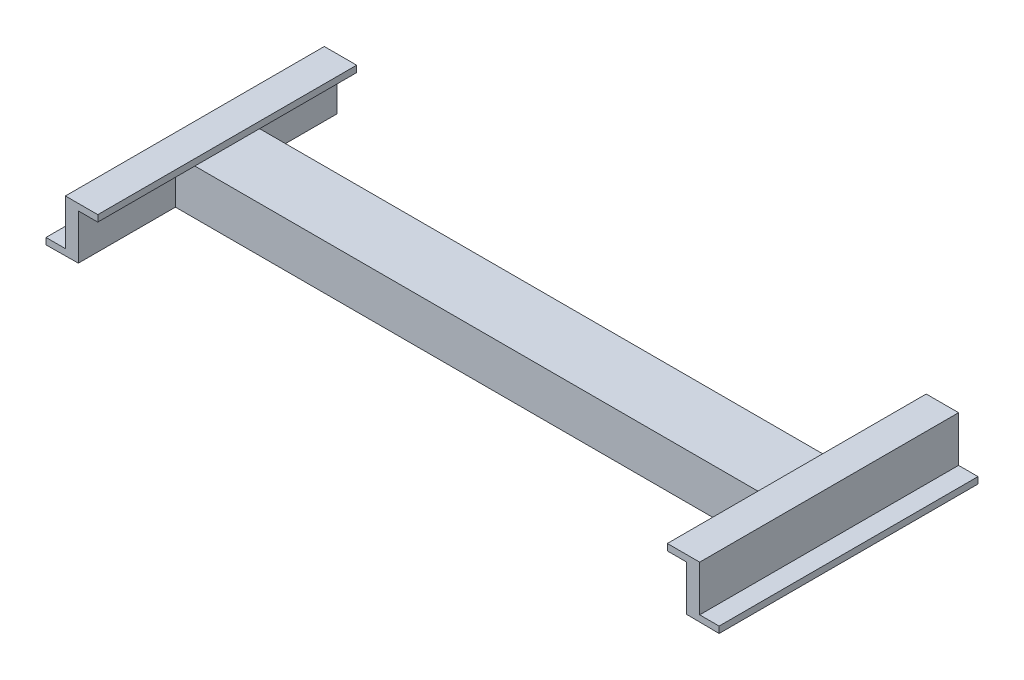
ISO-10303-21;
HEADER;
FILE_DESCRIPTION(('STEP AP214'),'2;1');
FILE_NAME('part.step','',(''),(''),'','','');
FILE_SCHEMA(('AUTOMOTIVE_DESIGN { 1 0 10303 214 1 1 1 1 }'));
ENDSEC;
DATA;
#1=APPLICATION_CONTEXT('core data for automotive mechanical design processes');
#2=APPLICATION_PROTOCOL_DEFINITION('international standard','automotive_design',2000,#1);
#3=PRODUCT_CONTEXT('',#1,'mechanical');
#4=PRODUCT('Part','Part','',(#3));
#5=PRODUCT_RELATED_PRODUCT_CATEGORY('part','',(#4));
#6=PRODUCT_DEFINITION_FORMATION('','',#4);
#7=PRODUCT_DEFINITION_CONTEXT('part definition',#1,'design');
#8=PRODUCT_DEFINITION('design','',#6,#7);
#9=PRODUCT_DEFINITION_SHAPE('','',#8);
#10=(LENGTH_UNIT() NAMED_UNIT(*) SI_UNIT(.MILLI.,.METRE.));
#11=(NAMED_UNIT(*) PLANE_ANGLE_UNIT() SI_UNIT($,.RADIAN.));
#12=(NAMED_UNIT(*) SI_UNIT($,.STERADIAN.) SOLID_ANGLE_UNIT());
#13=UNCERTAINTY_MEASURE_WITH_UNIT(LENGTH_MEASURE(1.E-05),#10,'distance_accuracy_value','');
#14=(GEOMETRIC_REPRESENTATION_CONTEXT(3) GLOBAL_UNCERTAINTY_ASSIGNED_CONTEXT((#13)) GLOBAL_UNIT_ASSIGNED_CONTEXT((#10,
#11,#12)) REPRESENTATION_CONTEXT('',''));
#15=CARTESIAN_POINT('',(0.,0.,0.));
#16=DIRECTION('',(0.,0.,1.));
#17=DIRECTION('',(1.,0.,0.));
#18=AXIS2_PLACEMENT_3D('',#15,#16,#17);
#19=CARTESIAN_POINT('',(-9.41334087256267,28.0433053768425,400.));
#20=DIRECTION('',(0.,1.,0.));
#21=DIRECTION('',(0.,0.,1.));
#22=AXIS2_PLACEMENT_3D('',#19,#20,#21);
#23=PLANE('',#22);
#24=DIRECTION('',(1.,0.,0.));
#25=VECTOR('',#24,1.);
#26=CARTESIAN_POINT('',(-479.413340872563,28.0433053768424,150.));
#27=LINE('',#26,#25);
#28=CARTESIAN_POINT('',(-39.4133408725628,28.0433053768424,150.));
#29=VERTEX_POINT('',#28);
#30=CARTESIAN_POINT('',(-9.41334087256267,28.0433053768424,150.));
#31=VERTEX_POINT('',#30);
#32=EDGE_CURVE('E369',#29,#31,#27,.T.);
#33=ORIENTED_EDGE('',*,*,#32,.F.);
#34=DIRECTION('',(0.,0.,-1.));
#35=VECTOR('',#34,1.);
#36=CARTESIAN_POINT('',(-39.4133408725627,28.0433053768425,400.));
#37=LINE('',#36,#35);
#38=CARTESIAN_POINT('',(-39.4133408725627,28.0433053768425,0.));
#39=VERTEX_POINT('',#38);
#40=EDGE_CURVE('E483',#29,#39,#37,.T.);
#41=ORIENTED_EDGE('',*,*,#40,.T.);
#42=DIRECTION('',(1.,0.,0.));
#43=VECTOR('',#42,1.);
#44=CARTESIAN_POINT('',(-9.41334087256267,28.0433053768425,0.));
#45=LINE('',#44,#43);
#46=CARTESIAN_POINT('',(-9.41334087256267,28.0433053768425,0.));
#47=VERTEX_POINT('',#46);
#48=EDGE_CURVE('E439',#39,#47,#45,.T.);
#49=ORIENTED_EDGE('',*,*,#48,.T.);
#50=DIRECTION('',(0.,0.,-1.));
#51=VECTOR('',#50,1.);
#52=CARTESIAN_POINT('',(-9.41334087256267,28.0433053768425,400.));
#53=LINE('',#52,#51);
#54=EDGE_CURVE('E478',#31,#47,#53,.T.);
#55=ORIENTED_EDGE('',*,*,#54,.F.);
#56=EDGE_LOOP('',(#33,#41,#49,#55));
#57=FACE_BOUND('',#56,.T.);
#58=ADVANCED_FACE('F39',(#57),#23,.F.);
#59=DIRECTION('',(1.,0.,0.));
#60=VECTOR('',#59,1.);
#61=CARTESIAN_POINT('',(-479.413340872563,28.0433053768424,250.));
#62=LINE('',#61,#60);
#63=CARTESIAN_POINT('',(-39.4133408725628,28.0433053768425,250.));
#64=VERTEX_POINT('',#63);
#65=CARTESIAN_POINT('',(-9.41334087256267,28.0433053768425,250.));
#66=VERTEX_POINT('',#65);
#67=EDGE_CURVE('E373',#64,#66,#62,.T.);
#68=ORIENTED_EDGE('',*,*,#67,.T.);
#69=CARTESIAN_POINT('',(-9.41334087256267,28.0433053768425,400.));
#70=VERTEX_POINT('',#69);
#71=EDGE_CURVE('E480',#70,#66,#53,.T.);
#72=ORIENTED_EDGE('',*,*,#71,.F.);
#73=DIRECTION('',(1.,0.,0.));
#74=VECTOR('',#73,1.);
#75=CARTESIAN_POINT('',(-9.41334087256267,28.0433053768425,400.));
#76=LINE('',#75,#74);
#77=CARTESIAN_POINT('',(-39.4133408725627,28.0433053768425,400.));
#78=VERTEX_POINT('',#77);
#79=EDGE_CURVE('E413',#78,#70,#76,.T.);
#80=ORIENTED_EDGE('',*,*,#79,.F.);
#81=EDGE_CURVE('E48',#78,#64,#37,.T.);
#82=ORIENTED_EDGE('',*,*,#81,.T.);
#83=EDGE_LOOP('',(#68,#72,#80,#82));
#84=FACE_BOUND('',#83,.T.);
#85=ADVANCED_FACE('F560',(#84),#23,.F.);
#86=CARTESIAN_POINT('',(-9.41334087256267,-41.9566946231576,400.));
#87=DIRECTION('',(1.,0.,0.));
#88=DIRECTION('',(0.,1.,0.));
#89=AXIS2_PLACEMENT_3D('',#86,#87,#88);
#90=PLANE('',#89);
#91=DIRECTION('',(0.,-1.,0.));
#92=VECTOR('',#91,1.);
#93=CARTESIAN_POINT('',(-9.41334087256267,28.0433053768424,150.));
#94=LINE('',#93,#92);
#95=CARTESIAN_POINT('',(-9.41334087256267,-41.9566946231576,150.));
#96=VERTEX_POINT('',#95);
#97=EDGE_CURVE('E346',#31,#96,#94,.T.);
#98=ORIENTED_EDGE('',*,*,#97,.F.);
#99=ORIENTED_EDGE('',*,*,#54,.T.);
#100=DIRECTION('',(0.,-1.,0.));
#101=VECTOR('',#100,1.);
#102=CARTESIAN_POINT('',(-9.41334087256267,-41.9566946231576,0.));
#103=LINE('',#102,#101);
#104=CARTESIAN_POINT('',(-9.41334087256267,-41.9566946231576,0.));
#105=VERTEX_POINT('',#104);
#106=EDGE_CURVE('E443',#47,#105,#103,.T.);
#107=ORIENTED_EDGE('',*,*,#106,.T.);
#108=DIRECTION('',(0.,0.,-1.));
#109=VECTOR('',#108,1.);
#110=CARTESIAN_POINT('',(-9.41334087256267,-41.9566946231576,400.));
#111=LINE('',#110,#109);
#112=EDGE_CURVE('E473',#96,#105,#111,.T.);
#113=ORIENTED_EDGE('',*,*,#112,.F.);
#114=EDGE_LOOP('',(#98,#99,#107,#113));
#115=FACE_BOUND('',#114,.T.);
#116=ADVANCED_FACE('F509',(#115),#90,.F.);
#117=DIRECTION('',(0.,1.,0.));
#118=VECTOR('',#117,1.);
#119=CARTESIAN_POINT('',(-9.41334087256267,-41.9566946231576,160.));
#120=LINE('',#119,#118);
#121=CARTESIAN_POINT('',(-9.41334087256267,-41.9566946231576,160.));
#122=VERTEX_POINT('',#121);
#123=CARTESIAN_POINT('',(-9.41334087256267,18.0433053768424,160.));
#124=VERTEX_POINT('',#123);
#125=EDGE_CURVE('E353',#122,#124,#120,.T.);
#126=ORIENTED_EDGE('',*,*,#125,.F.);
#127=CARTESIAN_POINT('',(-9.41334087256267,-41.9566946231576,240.));
#128=VERTEX_POINT('',#127);
#129=EDGE_CURVE('E479',#128,#122,#111,.T.);
#130=ORIENTED_EDGE('',*,*,#129,.F.);
#131=DIRECTION('',(0.,-1.,0.));
#132=VECTOR('',#131,1.);
#133=CARTESIAN_POINT('',(-9.41334087256267,18.0433053768424,240.));
#134=LINE('',#133,#132);
#135=CARTESIAN_POINT('',(-9.41334087256267,18.0433053768424,240.));
#136=VERTEX_POINT('',#135);
#137=EDGE_CURVE('E359',#136,#128,#134,.T.);
#138=ORIENTED_EDGE('',*,*,#137,.F.);
#139=DIRECTION('',(0.,0.,1.));
#140=VECTOR('',#139,1.);
#141=CARTESIAN_POINT('',(-9.41334087256267,18.0433053768424,160.));
#142=LINE('',#141,#140);
#143=EDGE_CURVE('E356',#124,#136,#142,.T.);
#144=ORIENTED_EDGE('',*,*,#143,.F.);
#145=EDGE_LOOP('',(#126,#130,#138,#144));
#146=FACE_BOUND('',#145,.T.);
#147=ADVANCED_FACE('F596',(#146),#90,.F.);
#148=DIRECTION('',(0.,1.,0.));
#149=VECTOR('',#148,1.);
#150=CARTESIAN_POINT('',(-9.41334087256267,28.0433053768425,250.));
#151=LINE('',#150,#149);
#152=CARTESIAN_POINT('',(-9.41334087256267,-41.9566946231576,250.));
#153=VERTEX_POINT('',#152);
#154=EDGE_CURVE('E366',#153,#66,#151,.T.);
#155=ORIENTED_EDGE('',*,*,#154,.F.);
#156=CARTESIAN_POINT('',(-9.41334087256267,-41.9566946231576,400.));
#157=VERTEX_POINT('',#156);
#158=EDGE_CURVE('E474',#157,#153,#111,.T.);
#159=ORIENTED_EDGE('',*,*,#158,.F.);
#160=DIRECTION('',(0.,-1.,0.));
#161=VECTOR('',#160,1.);
#162=CARTESIAN_POINT('',(-9.41334087256267,-41.9566946231576,400.));
#163=LINE('',#162,#161);
#164=EDGE_CURVE('E416',#70,#157,#163,.T.);
#165=ORIENTED_EDGE('',*,*,#164,.F.);
#166=ORIENTED_EDGE('',*,*,#71,.T.);
#167=EDGE_LOOP('',(#155,#159,#165,#166));
#168=FACE_BOUND('',#167,.T.);
#169=ADVANCED_FACE('F633',(#168),#90,.F.);
#170=CARTESIAN_POINT('',(-39.4133408725627,38.0433053768424,400.));
#171=DIRECTION('',(0.,-1.,0.));
#172=DIRECTION('',(0.,0.,-1.));
#173=AXIS2_PLACEMENT_3D('',#170,#171,#172);
#174=PLANE('',#173);
#175=DIRECTION('',(-1.,0.,0.));
#176=VECTOR('',#175,1.);
#177=CARTESIAN_POINT('',(-39.4133408725627,38.0433053768424,0.));
#178=LINE('',#177,#176);
#179=CARTESIAN_POINT('',(10.5866591274373,38.0433053768424,0.));
#180=VERTEX_POINT('',#179);
#181=CARTESIAN_POINT('',(-39.4133408725627,38.0433053768424,0.));
#182=VERTEX_POINT('',#181);
#183=EDGE_CURVE('E404',#180,#182,#178,.T.);
#184=ORIENTED_EDGE('',*,*,#183,.T.);
#185=DIRECTION('',(0.,0.,-1.));
#186=VECTOR('',#185,1.);
#187=CARTESIAN_POINT('',(-39.4133408725627,38.0433053768424,400.));
#188=LINE('',#187,#186);
#189=CARTESIAN_POINT('',(-39.4133408725627,38.0433053768424,400.));
#190=VERTEX_POINT('',#189);
#191=EDGE_CURVE('E11',#190,#182,#188,.T.);
#192=ORIENTED_EDGE('',*,*,#191,.F.);
#193=DIRECTION('',(-1.,0.,0.));
#194=VECTOR('',#193,1.);
#195=CARTESIAN_POINT('',(-39.4133408725627,38.0433053768424,400.));
#196=LINE('',#195,#194);
#197=CARTESIAN_POINT('',(10.5866591274373,38.0433053768424,400.));
#198=VERTEX_POINT('',#197);
#199=EDGE_CURVE('E405',#198,#190,#196,.T.);
#200=ORIENTED_EDGE('',*,*,#199,.F.);
#201=DIRECTION('',(0.,0.,-1.));
#202=VECTOR('',#201,1.);
#203=CARTESIAN_POINT('',(10.5866591274373,38.0433053768424,400.));
#204=LINE('',#203,#202);
#205=EDGE_CURVE('E431',#198,#180,#204,.T.);
#206=ORIENTED_EDGE('',*,*,#205,.T.);
#207=EDGE_LOOP('',(#184,#192,#200,#206));
#208=FACE_BOUND('',#207,.T.);
#209=ADVANCED_FACE('F41',(#208),#174,.F.);
#210=CARTESIAN_POINT('',(-39.4133408725627,28.0433053768425,400.));
#211=DIRECTION('',(1.,0.,0.));
#212=DIRECTION('',(0.,0.,-1.));
#213=AXIS2_PLACEMENT_3D('',#210,#211,#212);
#214=PLANE('',#213);
#215=DIRECTION('',(0.,-1.,0.));
#216=VECTOR('',#215,1.);
#217=CARTESIAN_POINT('',(-39.4133408725627,28.0433053768425,0.));
#218=LINE('',#217,#216);
#219=EDGE_CURVE('E435',#182,#39,#218,.T.);
#220=ORIENTED_EDGE('',*,*,#219,.T.);
#221=ORIENTED_EDGE('',*,*,#40,.F.);
#222=DIRECTION('',(0.,0.,-1.));
#223=VECTOR('',#222,1.);
#224=CARTESIAN_POINT('',(-39.4133408725627,28.0433053768425,400.));
#225=LINE('',#224,#223);
#226=EDGE_CURVE('E401',#64,#29,#225,.T.);
#227=ORIENTED_EDGE('',*,*,#226,.F.);
#228=ORIENTED_EDGE('',*,*,#81,.F.);
#229=DIRECTION('',(0.,-1.,0.));
#230=VECTOR('',#229,1.);
#231=CARTESIAN_POINT('',(-39.4133408725627,28.0433053768425,400.));
#232=LINE('',#231,#230);
#233=EDGE_CURVE('E409',#190,#78,#232,.T.);
#234=ORIENTED_EDGE('',*,*,#233,.F.);
#235=ORIENTED_EDGE('',*,*,#191,.T.);
#236=EDGE_LOOP('',(#220,#221,#227,#228,#234,#235));
#237=FACE_BOUND('',#236,.T.);
#238=ADVANCED_FACE('F499',(#237),#214,.F.);
#239=CARTESIAN_POINT('',(40.5866591274373,-42.4739360024679,400.));
#240=DIRECTION('',(0.0103442741023999,0.999946496565338,0.));
#241=DIRECTION('',(-0.999946496565339,0.0103442741023999,0.));
#242=AXIS2_PLACEMENT_3D('',#239,#240,#241);
#243=PLANE('',#242);
#244=DIRECTION('',(0.999946496565338,-0.0103442741023998,0.));
#245=VECTOR('',#244,1.);
#246=CARTESIAN_POINT('',(40.5866591274373,-42.4739360024679,0.));
#247=LINE('',#246,#245);
#248=CARTESIAN_POINT('',(40.5866591274373,-42.4739360024679,0.));
#249=VERTEX_POINT('',#248);
#250=EDGE_CURVE('E447',#105,#249,#247,.T.);
#251=ORIENTED_EDGE('',*,*,#250,.T.);
#252=DIRECTION('',(0.,0.,-1.));
#253=VECTOR('',#252,1.);
#254=CARTESIAN_POINT('',(40.5866591274373,-42.4739360024679,400.));
#255=LINE('',#254,#253);
#256=CARTESIAN_POINT('',(40.5866591274373,-42.4739360024679,400.));
#257=VERTEX_POINT('',#256);
#258=EDGE_CURVE('E469',#257,#249,#255,.T.);
#259=ORIENTED_EDGE('',*,*,#258,.F.);
#260=DIRECTION('',(0.999946496565338,-0.0103442741023998,0.));
#261=VECTOR('',#260,1.);
#262=CARTESIAN_POINT('',(40.5866591274373,-42.4739360024679,400.));
#263=LINE('',#262,#261);
#264=EDGE_CURVE('E419',#157,#257,#263,.T.);
#265=ORIENTED_EDGE('',*,*,#264,.F.);
#266=ORIENTED_EDGE('',*,*,#158,.T.);
#267=DIRECTION('',(0.,0.,1.));
#268=VECTOR('',#267,1.);
#269=CARTESIAN_POINT('',(-9.41334087256267,-41.9566946231576,240.));
#270=LINE('',#269,#268);
#271=EDGE_CURVE('E363',#128,#153,#270,.T.);
#272=ORIENTED_EDGE('',*,*,#271,.F.);
#273=ORIENTED_EDGE('',*,*,#129,.T.);
#274=DIRECTION('',(0.,0.,1.));
#275=VECTOR('',#274,1.);
#276=CARTESIAN_POINT('',(-9.41334087256267,-41.9566946231576,150.));
#277=LINE('',#276,#275);
#278=EDGE_CURVE('E350',#96,#122,#277,.T.);
#279=ORIENTED_EDGE('',*,*,#278,.F.);
#280=ORIENTED_EDGE('',*,*,#112,.T.);
#281=EDGE_LOOP('',(#251,#259,#265,#266,#272,#273,#279,#280));
#282=FACE_BOUND('',#281,.T.);
#283=ADVANCED_FACE('F584',(#282),#243,.F.);
#284=CARTESIAN_POINT('',(40.5866591274373,-32.4739360024679,400.));
#285=DIRECTION('',(-1.,0.,0.));
#286=DIRECTION('',(0.,-1.,0.));
#287=AXIS2_PLACEMENT_3D('',#284,#285,#286);
#288=PLANE('',#287);
#289=DIRECTION('',(0.,1.,0.));
#290=VECTOR('',#289,1.);
#291=CARTESIAN_POINT('',(40.5866591274373,-32.4739360024679,0.));
#292=LINE('',#291,#290);
#293=CARTESIAN_POINT('',(40.5866591274373,-32.4739360024679,0.));
#294=VERTEX_POINT('',#293);
#295=EDGE_CURVE('E450',#249,#294,#292,.T.);
#296=ORIENTED_EDGE('',*,*,#295,.T.);
#297=DIRECTION('',(0.,0.,-1.));
#298=VECTOR('',#297,1.);
#299=CARTESIAN_POINT('',(40.5866591274373,-32.4739360024679,400.));
#300=LINE('',#299,#298);
#301=CARTESIAN_POINT('',(40.5866591274373,-32.4739360024679,400.));
#302=VERTEX_POINT('',#301);
#303=EDGE_CURVE('E465',#302,#294,#300,.T.);
#304=ORIENTED_EDGE('',*,*,#303,.F.);
#305=DIRECTION('',(0.,1.,0.));
#306=VECTOR('',#305,1.);
#307=CARTESIAN_POINT('',(40.5866591274373,-32.4739360024679,400.));
#308=LINE('',#307,#306);
#309=EDGE_CURVE('E422',#257,#302,#308,.T.);
#310=ORIENTED_EDGE('',*,*,#309,.F.);
#311=ORIENTED_EDGE('',*,*,#258,.T.);
#312=EDGE_LOOP('',(#296,#304,#310,#311));
#313=FACE_BOUND('',#312,.T.);
#314=ADVANCED_FACE('F580',(#313),#288,.F.);
#315=CARTESIAN_POINT('',(10.5866591274373,-32.4739360024679,400.));
#316=DIRECTION('',(0.,-1.,0.));
#317=DIRECTION('',(0.,0.,-1.));
#318=AXIS2_PLACEMENT_3D('',#315,#316,#317);
#319=PLANE('',#318);
#320=DIRECTION('',(-1.,0.,0.));
#321=VECTOR('',#320,1.);
#322=CARTESIAN_POINT('',(10.5866591274373,-32.4739360024679,0.));
#323=LINE('',#322,#321);
#324=CARTESIAN_POINT('',(10.5866591274373,-32.4739360024679,0.));
#325=VERTEX_POINT('',#324);
#326=EDGE_CURVE('E453',#294,#325,#323,.T.);
#327=ORIENTED_EDGE('',*,*,#326,.T.);
#328=DIRECTION('',(0.,0.,-1.));
#329=VECTOR('',#328,1.);
#330=CARTESIAN_POINT('',(10.5866591274373,-32.4739360024679,400.));
#331=LINE('',#330,#329);
#332=CARTESIAN_POINT('',(10.5866591274373,-32.4739360024679,400.));
#333=VERTEX_POINT('',#332);
#334=EDGE_CURVE('E461',#333,#325,#331,.T.);
#335=ORIENTED_EDGE('',*,*,#334,.F.);
#336=DIRECTION('',(-1.,0.,0.));
#337=VECTOR('',#336,1.);
#338=CARTESIAN_POINT('',(10.5866591274373,-32.4739360024679,400.));
#339=LINE('',#338,#337);
#340=EDGE_CURVE('E425',#302,#333,#339,.T.);
#341=ORIENTED_EDGE('',*,*,#340,.F.);
#342=ORIENTED_EDGE('',*,*,#303,.T.);
#343=EDGE_LOOP('',(#327,#335,#341,#342));
#344=FACE_BOUND('',#343,.T.);
#345=ADVANCED_FACE('F576',(#344),#319,.F.);
#346=CARTESIAN_POINT('',(10.5866591274373,38.0433053768424,400.));
#347=DIRECTION('',(-1.,0.,0.));
#348=DIRECTION('',(0.,-1.,0.));
#349=AXIS2_PLACEMENT_3D('',#346,#347,#348);
#350=PLANE('',#349);
#351=DIRECTION('',(0.,1.,0.));
#352=VECTOR('',#351,1.);
#353=CARTESIAN_POINT('',(10.5866591274373,38.0433053768424,0.));
#354=LINE('',#353,#352);
#355=EDGE_CURVE('E410',#325,#180,#354,.T.);
#356=ORIENTED_EDGE('',*,*,#355,.T.);
#357=ORIENTED_EDGE('',*,*,#205,.F.);
#358=DIRECTION('',(0.,1.,0.));
#359=VECTOR('',#358,1.);
#360=CARTESIAN_POINT('',(10.5866591274373,38.0433053768424,400.));
#361=LINE('',#360,#359);
#362=EDGE_CURVE('E428',#333,#198,#361,.T.);
#363=ORIENTED_EDGE('',*,*,#362,.F.);
#364=ORIENTED_EDGE('',*,*,#334,.T.);
#365=EDGE_LOOP('',(#356,#357,#363,#364));
#366=FACE_BOUND('',#365,.T.);
#367=ADVANCED_FACE('F572',(#366),#350,.F.);
#368=CARTESIAN_POINT('',(0.,0.,400.));
#369=DIRECTION('',(0.,0.,-1.));
#370=DIRECTION('',(-1.,0.,0.));
#371=AXIS2_PLACEMENT_3D('',#368,#369,#370);
#372=PLANE('',#371);
#373=ORIENTED_EDGE('',*,*,#199,.T.);
#374=ORIENTED_EDGE('',*,*,#233,.T.);
#375=ORIENTED_EDGE('',*,*,#79,.T.);
#376=ORIENTED_EDGE('',*,*,#164,.T.);
#377=ORIENTED_EDGE('',*,*,#264,.T.);
#378=ORIENTED_EDGE('',*,*,#309,.T.);
#379=ORIENTED_EDGE('',*,*,#340,.T.);
#380=ORIENTED_EDGE('',*,*,#362,.T.);
#381=EDGE_LOOP('',(#373,#374,#375,#376,#377,#378,#379,#380));
#382=FACE_BOUND('',#381,.T.);
#383=ADVANCED_FACE('F563',(#382),#372,.F.);
#384=CARTESIAN_POINT('',(0.,0.,0.));
#385=DIRECTION('',(0.,0.,-1.));
#386=DIRECTION('',(-1.,0.,0.));
#387=AXIS2_PLACEMENT_3D('',#384,#385,#386);
#388=PLANE('',#387);
#389=ORIENTED_EDGE('',*,*,#183,.F.);
#390=ORIENTED_EDGE('',*,*,#355,.F.);
#391=ORIENTED_EDGE('',*,*,#326,.F.);
#392=ORIENTED_EDGE('',*,*,#295,.F.);
#393=ORIENTED_EDGE('',*,*,#250,.F.);
#394=ORIENTED_EDGE('',*,*,#106,.F.);
#395=ORIENTED_EDGE('',*,*,#48,.F.);
#396=ORIENTED_EDGE('',*,*,#219,.F.);
#397=EDGE_LOOP('',(#389,#390,#391,#392,#393,#394,#395,#396));
#398=FACE_BOUND('',#397,.T.);
#399=ADVANCED_FACE('F503',(#398),#388,.T.);
#400=CARTESIAN_POINT('',(-479.413340872563,28.0433053768424,150.));
#401=DIRECTION('',(0.,-1.,0.));
#402=DIRECTION('',(0.,0.,-1.));
#403=AXIS2_PLACEMENT_3D('',#400,#401,#402);
#404=PLANE('',#403);
#405=CARTESIAN_POINT('',(-919.413340872563,28.0433053768424,150.));
#406=VERTEX_POINT('',#405);
#407=EDGE_CURVE('E55',#406,#29,#27,.T.);
#408=ORIENTED_EDGE('',*,*,#407,.F.);
#409=DIRECTION('',(0.,0.,-1.));
#410=VECTOR('',#409,1.);
#411=CARTESIAN_POINT('',(-919.413340872563,28.0433053768424,400.));
#412=LINE('',#411,#410);
#413=CARTESIAN_POINT('',(-919.413340872563,28.0433053768424,250.));
#414=VERTEX_POINT('',#413);
#415=EDGE_CURVE('E60',#414,#406,#412,.T.);
#416=ORIENTED_EDGE('',*,*,#415,.F.);
#417=EDGE_CURVE('E379',#414,#64,#62,.T.);
#418=ORIENTED_EDGE('',*,*,#417,.T.);
#419=ORIENTED_EDGE('',*,*,#226,.T.);
#420=EDGE_LOOP('',(#408,#416,#418,#419));
#421=FACE_BOUND('',#420,.T.);
#422=ADVANCED_FACE('F558',(#421),#404,.F.);
#423=CARTESIAN_POINT('',(-479.413340872563,28.0433053768424,150.));
#424=DIRECTION('',(0.,0.,1.));
#425=DIRECTION('',(0.,-1.,0.));
#426=AXIS2_PLACEMENT_3D('',#423,#424,#425);
#427=PLANE('',#426);
#428=ORIENTED_EDGE('',*,*,#97,.T.);
#429=DIRECTION('',(1.,0.,0.));
#430=VECTOR('',#429,1.);
#431=CARTESIAN_POINT('',(-479.413340872563,-41.9566946231576,150.));
#432=LINE('',#431,#430);
#433=CARTESIAN_POINT('',(-949.413340872563,-41.9566946231576,150.));
#434=VERTEX_POINT('',#433);
#435=EDGE_CURVE('E398',#434,#96,#432,.T.);
#436=ORIENTED_EDGE('',*,*,#435,.F.);
#437=DIRECTION('',(0.,-1.,0.));
#438=VECTOR('',#437,1.);
#439=CARTESIAN_POINT('',(-949.413340872563,28.0433053768424,150.));
#440=LINE('',#439,#438);
#441=CARTESIAN_POINT('',(-949.413340872563,28.0433053768424,150.));
#442=VERTEX_POINT('',#441);
#443=EDGE_CURVE('E224',#442,#434,#440,.T.);
#444=ORIENTED_EDGE('',*,*,#443,.F.);
#445=EDGE_CURVE('E370',#442,#406,#27,.T.);
#446=ORIENTED_EDGE('',*,*,#445,.T.);
#447=ORIENTED_EDGE('',*,*,#407,.T.);
#448=ORIENTED_EDGE('',*,*,#32,.T.);
#449=EDGE_LOOP('',(#428,#436,#444,#446,#447,#448));
#450=FACE_BOUND('',#449,.T.);
#451=ADVANCED_FACE('F611',(#450),#427,.F.);
#452=CARTESIAN_POINT('',(-479.413340872563,-41.9566946231576,150.));
#453=DIRECTION('',(0.,1.,0.));
#454=DIRECTION('',(-1.,0.,0.));
#455=AXIS2_PLACEMENT_3D('',#452,#453,#454);
#456=PLANE('',#455);
#457=ORIENTED_EDGE('',*,*,#278,.T.);
#458=DIRECTION('',(1.,0.,0.));
#459=VECTOR('',#458,1.);
#460=CARTESIAN_POINT('',(-479.413340872563,-41.9566946231576,160.));
#461=LINE('',#460,#459);
#462=CARTESIAN_POINT('',(-949.413340872563,-41.9566946231576,160.));
#463=VERTEX_POINT('',#462);
#464=EDGE_CURVE('E394',#463,#122,#461,.T.);
#465=ORIENTED_EDGE('',*,*,#464,.F.);
#466=DIRECTION('',(0.,0.,1.));
#467=VECTOR('',#466,1.);
#468=CARTESIAN_POINT('',(-949.413340872563,-41.9566946231576,150.));
#469=LINE('',#468,#467);
#470=EDGE_CURVE('E342',#434,#463,#469,.T.);
#471=ORIENTED_EDGE('',*,*,#470,.F.);
#472=ORIENTED_EDGE('',*,*,#435,.T.);
#473=EDGE_LOOP('',(#457,#465,#471,#472));
#474=FACE_BOUND('',#473,.T.);
#475=ADVANCED_FACE('F589',(#474),#456,.F.);
#476=CARTESIAN_POINT('',(-479.413340872563,-41.9566946231576,160.));
#477=DIRECTION('',(0.,0.,-1.));
#478=DIRECTION('',(-1.,0.,0.));
#479=AXIS2_PLACEMENT_3D('',#476,#477,#478);
#480=PLANE('',#479);
#481=ORIENTED_EDGE('',*,*,#125,.T.);
#482=DIRECTION('',(1.,0.,0.));
#483=VECTOR('',#482,1.);
#484=CARTESIAN_POINT('',(-479.413340872563,18.0433053768424,160.));
#485=LINE('',#484,#483);
#486=CARTESIAN_POINT('',(-949.413340872563,18.0433053768424,160.));
#487=VERTEX_POINT('',#486);
#488=EDGE_CURVE('E390',#487,#124,#485,.T.);
#489=ORIENTED_EDGE('',*,*,#488,.F.);
#490=DIRECTION('',(0.,1.,0.));
#491=VECTOR('',#490,1.);
#492=CARTESIAN_POINT('',(-949.413340872563,-41.9566946231576,160.));
#493=LINE('',#492,#491);
#494=EDGE_CURVE('E338',#463,#487,#493,.T.);
#495=ORIENTED_EDGE('',*,*,#494,.F.);
#496=ORIENTED_EDGE('',*,*,#464,.T.);
#497=EDGE_LOOP('',(#481,#489,#495,#496));
#498=FACE_BOUND('',#497,.T.);
#499=ADVANCED_FACE('F593',(#498),#480,.F.);
#500=CARTESIAN_POINT('',(-479.413340872563,18.0433053768424,160.));
#501=DIRECTION('',(0.,1.,0.));
#502=DIRECTION('',(-1.,0.,0.));
#503=AXIS2_PLACEMENT_3D('',#500,#501,#502);
#504=PLANE('',#503);
#505=ORIENTED_EDGE('',*,*,#143,.T.);
#506=DIRECTION('',(1.,0.,0.));
#507=VECTOR('',#506,1.);
#508=CARTESIAN_POINT('',(-479.413340872563,18.0433053768424,240.));
#509=LINE('',#508,#507);
#510=CARTESIAN_POINT('',(-949.413340872563,18.0433053768424,240.));
#511=VERTEX_POINT('',#510);
#512=EDGE_CURVE('E386',#511,#136,#509,.T.);
#513=ORIENTED_EDGE('',*,*,#512,.F.);
#514=DIRECTION('',(0.,0.,1.));
#515=VECTOR('',#514,1.);
#516=CARTESIAN_POINT('',(-949.413340872563,18.0433053768424,160.));
#517=LINE('',#516,#515);
#518=EDGE_CURVE('E334',#487,#511,#517,.T.);
#519=ORIENTED_EDGE('',*,*,#518,.F.);
#520=ORIENTED_EDGE('',*,*,#488,.T.);
#521=EDGE_LOOP('',(#505,#513,#519,#520));
#522=FACE_BOUND('',#521,.T.);
#523=ADVANCED_FACE('F599',(#522),#504,.F.);
#524=CARTESIAN_POINT('',(-479.413340872563,18.0433053768424,240.));
#525=DIRECTION('',(0.,0.,1.));
#526=DIRECTION('',(1.,0.,0.));
#527=AXIS2_PLACEMENT_3D('',#524,#525,#526);
#528=PLANE('',#527);
#529=ORIENTED_EDGE('',*,*,#137,.T.);
#530=DIRECTION('',(1.,0.,0.));
#531=VECTOR('',#530,1.);
#532=CARTESIAN_POINT('',(-479.413340872563,-41.9566946231576,240.));
#533=LINE('',#532,#531);
#534=CARTESIAN_POINT('',(-949.413340872563,-41.9566946231576,240.));
#535=VERTEX_POINT('',#534);
#536=EDGE_CURVE('E383',#535,#128,#533,.T.);
#537=ORIENTED_EDGE('',*,*,#536,.F.);
#538=DIRECTION('',(0.,-1.,0.));
#539=VECTOR('',#538,1.);
#540=CARTESIAN_POINT('',(-949.413340872563,18.0433053768424,240.));
#541=LINE('',#540,#539);
#542=EDGE_CURVE('E330',#511,#535,#541,.T.);
#543=ORIENTED_EDGE('',*,*,#542,.F.);
#544=ORIENTED_EDGE('',*,*,#512,.T.);
#545=EDGE_LOOP('',(#529,#537,#543,#544));
#546=FACE_BOUND('',#545,.T.);
#547=ADVANCED_FACE('F603',(#546),#528,.F.);
#548=CARTESIAN_POINT('',(-479.413340872563,-41.9566946231576,240.));
#549=DIRECTION('',(0.,1.,0.));
#550=DIRECTION('',(-1.,0.,0.));
#551=AXIS2_PLACEMENT_3D('',#548,#549,#550);
#552=PLANE('',#551);
#553=ORIENTED_EDGE('',*,*,#271,.T.);
#554=DIRECTION('',(1.,0.,0.));
#555=VECTOR('',#554,1.);
#556=CARTESIAN_POINT('',(-479.413340872563,-41.9566946231576,250.));
#557=LINE('',#556,#555);
#558=CARTESIAN_POINT('',(-949.413340872563,-41.9566946231576,250.));
#559=VERTEX_POINT('',#558);
#560=EDGE_CURVE('E378',#559,#153,#557,.T.);
#561=ORIENTED_EDGE('',*,*,#560,.F.);
#562=DIRECTION('',(0.,0.,1.));
#563=VECTOR('',#562,1.);
#564=CARTESIAN_POINT('',(-949.413340872563,-41.9566946231576,240.));
#565=LINE('',#564,#563);
#566=EDGE_CURVE('E326',#535,#559,#565,.T.);
#567=ORIENTED_EDGE('',*,*,#566,.F.);
#568=ORIENTED_EDGE('',*,*,#536,.T.);
#569=EDGE_LOOP('',(#553,#561,#567,#568));
#570=FACE_BOUND('',#569,.T.);
#571=ADVANCED_FACE('F717',(#570),#552,.F.);
#572=CARTESIAN_POINT('',(-479.413340872563,28.0433053768424,250.));
#573=DIRECTION('',(0.,0.,-1.));
#574=DIRECTION('',(0.,1.,0.));
#575=AXIS2_PLACEMENT_3D('',#572,#573,#574);
#576=PLANE('',#575);
#577=ORIENTED_EDGE('',*,*,#154,.T.);
#578=ORIENTED_EDGE('',*,*,#67,.F.);
#579=ORIENTED_EDGE('',*,*,#417,.F.);
#580=CARTESIAN_POINT('',(-949.413340872563,28.0433053768424,250.));
#581=VERTEX_POINT('',#580);
#582=EDGE_CURVE('E374',#581,#414,#62,.T.);
#583=ORIENTED_EDGE('',*,*,#582,.F.);
#584=DIRECTION('',(0.,1.,0.));
#585=VECTOR('',#584,1.);
#586=CARTESIAN_POINT('',(-949.413340872563,28.0433053768424,250.));
#587=LINE('',#586,#585);
#588=EDGE_CURVE('E322',#559,#581,#587,.T.);
#589=ORIENTED_EDGE('',*,*,#588,.F.);
#590=ORIENTED_EDGE('',*,*,#560,.T.);
#591=EDGE_LOOP('',(#577,#578,#579,#583,#589,#590));
#592=FACE_BOUND('',#591,.T.);
#593=ADVANCED_FACE('F556',(#592),#576,.F.);
#594=CARTESIAN_POINT('',(-949.413340872563,-41.9566946231576,400.));
#595=DIRECTION('',(1.,0.,0.));
#596=DIRECTION('',(0.,1.,0.));
#597=AXIS2_PLACEMENT_3D('',#594,#595,#596);
#598=PLANE('',#597);
#599=ORIENTED_EDGE('',*,*,#443,.T.);
#600=DIRECTION('',(0.,0.,-1.));
#601=VECTOR('',#600,1.);
#602=CARTESIAN_POINT('',(-949.413340872563,-41.9566946231576,400.));
#603=LINE('',#602,#601);
#604=CARTESIAN_POINT('',(-949.413340872563,-41.9566946231576,0.));
#605=VERTEX_POINT('',#604);
#606=EDGE_CURVE('E305',#434,#605,#603,.T.);
#607=ORIENTED_EDGE('',*,*,#606,.T.);
#608=DIRECTION('',(0.,-1.,0.));
#609=VECTOR('',#608,1.);
#610=CARTESIAN_POINT('',(-949.413340872563,-41.9566946231576,0.));
#611=LINE('',#610,#609);
#612=CARTESIAN_POINT('',(-949.413340872563,28.0433053768424,0.));
#613=VERTEX_POINT('',#612);
#614=EDGE_CURVE('E282',#613,#605,#611,.T.);
#615=ORIENTED_EDGE('',*,*,#614,.F.);
#616=DIRECTION('',(0.,0.,-1.));
#617=VECTOR('',#616,1.);
#618=CARTESIAN_POINT('',(-949.413340872563,28.0433053768424,400.));
#619=LINE('',#618,#617);
#620=EDGE_CURVE('E300',#442,#613,#619,.T.);
#621=ORIENTED_EDGE('',*,*,#620,.F.);
#622=EDGE_LOOP('',(#599,#607,#615,#621));
#623=FACE_BOUND('',#622,.T.);
#624=ADVANCED_FACE('F609',(#623),#598,.T.);
#625=ORIENTED_EDGE('',*,*,#494,.T.);
#626=ORIENTED_EDGE('',*,*,#518,.T.);
#627=ORIENTED_EDGE('',*,*,#542,.T.);
#628=EDGE_CURVE('E311',#535,#463,#603,.T.);
#629=ORIENTED_EDGE('',*,*,#628,.T.);
#630=EDGE_LOOP('',(#625,#626,#627,#629));
#631=FACE_BOUND('',#630,.T.);
#632=ADVANCED_FACE('F607',(#631),#598,.T.);
#633=ORIENTED_EDGE('',*,*,#588,.T.);
#634=CARTESIAN_POINT('',(-949.413340872563,28.0433053768424,400.));
#635=VERTEX_POINT('',#634);
#636=EDGE_CURVE('E301',#635,#581,#619,.T.);
#637=ORIENTED_EDGE('',*,*,#636,.F.);
#638=DIRECTION('',(0.,-1.,0.));
#639=VECTOR('',#638,1.);
#640=CARTESIAN_POINT('',(-949.413340872563,-41.9566946231576,400.));
#641=LINE('',#640,#639);
#642=CARTESIAN_POINT('',(-949.413340872563,-41.9566946231576,400.));
#643=VERTEX_POINT('',#642);
#644=EDGE_CURVE('E254',#635,#643,#641,.T.);
#645=ORIENTED_EDGE('',*,*,#644,.T.);
#646=EDGE_CURVE('E306',#643,#559,#603,.T.);
#647=ORIENTED_EDGE('',*,*,#646,.T.);
#648=EDGE_LOOP('',(#633,#637,#645,#647));
#649=FACE_BOUND('',#648,.T.);
#650=ADVANCED_FACE('F551',(#649),#598,.T.);
#651=CARTESIAN_POINT('',(-949.413340872563,28.0433053768424,400.));
#652=DIRECTION('',(0.,-1.,0.));
#653=DIRECTION('',(1.,0.,0.));
#654=AXIS2_PLACEMENT_3D('',#651,#652,#653);
#655=PLANE('',#654);
#656=ORIENTED_EDGE('',*,*,#445,.F.);
#657=ORIENTED_EDGE('',*,*,#620,.T.);
#658=DIRECTION('',(-1.,0.,0.));
#659=VECTOR('',#658,1.);
#660=CARTESIAN_POINT('',(-949.413340872563,28.0433053768424,0.));
#661=LINE('',#660,#659);
#662=CARTESIAN_POINT('',(-919.413340872563,28.0433053768424,0.));
#663=VERTEX_POINT('',#662);
#664=EDGE_CURVE('E286',#663,#613,#661,.T.);
#665=ORIENTED_EDGE('',*,*,#664,.F.);
#666=EDGE_CURVE('E295',#406,#663,#412,.T.);
#667=ORIENTED_EDGE('',*,*,#666,.F.);
#668=EDGE_LOOP('',(#656,#657,#665,#667));
#669=FACE_BOUND('',#668,.T.);
#670=ADVANCED_FACE('F532',(#669),#655,.T.);
#671=ORIENTED_EDGE('',*,*,#582,.T.);
#672=CARTESIAN_POINT('',(-919.413340872563,28.0433053768424,400.));
#673=VERTEX_POINT('',#672);
#674=EDGE_CURVE('E296',#673,#414,#412,.T.);
#675=ORIENTED_EDGE('',*,*,#674,.F.);
#676=DIRECTION('',(-1.,0.,0.));
#677=VECTOR('',#676,1.);
#678=CARTESIAN_POINT('',(-949.413340872563,28.0433053768424,400.));
#679=LINE('',#678,#677);
#680=EDGE_CURVE('E258',#673,#635,#679,.T.);
#681=ORIENTED_EDGE('',*,*,#680,.T.);
#682=ORIENTED_EDGE('',*,*,#636,.T.);
#683=EDGE_LOOP('',(#671,#675,#681,#682));
#684=FACE_BOUND('',#683,.T.);
#685=ADVANCED_FACE('F554',(#684),#655,.T.);
#686=CARTESIAN_POINT('',(-919.413340872563,38.0433053768424,400.));
#687=DIRECTION('',(0.,1.,0.));
#688=DIRECTION('',(-1.,0.,0.));
#689=AXIS2_PLACEMENT_3D('',#686,#687,#688);
#690=PLANE('',#689);
#691=DIRECTION('',(1.,0.,0.));
#692=VECTOR('',#691,1.);
#693=CARTESIAN_POINT('',(-919.413340872563,38.0433053768424,0.));
#694=LINE('',#693,#692);
#695=CARTESIAN_POINT('',(-969.413340872563,38.0433053768424,0.));
#696=VERTEX_POINT('',#695);
#697=CARTESIAN_POINT('',(-919.413340872563,38.0433053768424,0.));
#698=VERTEX_POINT('',#697);
#699=EDGE_CURVE('E218',#696,#698,#694,.T.);
#700=ORIENTED_EDGE('',*,*,#699,.F.);
#701=DIRECTION('',(0.,0.,-1.));
#702=VECTOR('',#701,1.);
#703=CARTESIAN_POINT('',(-969.413340872563,38.0433053768424,400.));
#704=LINE('',#703,#702);
#705=CARTESIAN_POINT('',(-969.413340872563,38.0433053768424,400.));
#706=VERTEX_POINT('',#705);
#707=EDGE_CURVE('E212',#706,#696,#704,.T.);
#708=ORIENTED_EDGE('',*,*,#707,.F.);
#709=DIRECTION('',(1.,0.,0.));
#710=VECTOR('',#709,1.);
#711=CARTESIAN_POINT('',(-919.413340872563,38.0433053768424,400.));
#712=LINE('',#711,#710);
#713=CARTESIAN_POINT('',(-919.413340872563,38.0433053768424,400.));
#714=VERTEX_POINT('',#713);
#715=EDGE_CURVE('E215',#706,#714,#712,.T.);
#716=ORIENTED_EDGE('',*,*,#715,.T.);
#717=DIRECTION('',(0.,0.,-1.));
#718=VECTOR('',#717,1.);
#719=CARTESIAN_POINT('',(-919.413340872563,38.0433053768424,400.));
#720=LINE('',#719,#718);
#721=EDGE_CURVE('E264',#714,#698,#720,.T.);
#722=ORIENTED_EDGE('',*,*,#721,.T.);
#723=EDGE_LOOP('',(#700,#708,#716,#722));
#724=FACE_BOUND('',#723,.T.);
#725=ADVANCED_FACE('F214',(#724),#690,.T.);
#726=CARTESIAN_POINT('',(-969.413340872563,38.0433053768424,400.));
#727=DIRECTION('',(-1.,0.,0.));
#728=DIRECTION('',(0.,-1.,0.));
#729=AXIS2_PLACEMENT_3D('',#726,#727,#728);
#730=PLANE('',#729);
#731=DIRECTION('',(0.,1.,0.));
#732=VECTOR('',#731,1.);
#733=CARTESIAN_POINT('',(-969.413340872563,38.0433053768424,0.));
#734=LINE('',#733,#732);
#735=CARTESIAN_POINT('',(-969.413340872563,-32.4739360024679,0.));
#736=VERTEX_POINT('',#735);
#737=EDGE_CURVE('E267',#736,#696,#734,.T.);
#738=ORIENTED_EDGE('',*,*,#737,.F.);
#739=DIRECTION('',(0.,0.,-1.));
#740=VECTOR('',#739,1.);
#741=CARTESIAN_POINT('',(-969.413340872563,-32.4739360024679,400.));
#742=LINE('',#741,#740);
#743=CARTESIAN_POINT('',(-969.413340872563,-32.4739360024679,400.));
#744=VERTEX_POINT('',#743);
#745=EDGE_CURVE('E225',#744,#736,#742,.T.);
#746=ORIENTED_EDGE('',*,*,#745,.F.);
#747=DIRECTION('',(0.,1.,0.));
#748=VECTOR('',#747,1.);
#749=CARTESIAN_POINT('',(-969.413340872563,38.0433053768424,400.));
#750=LINE('',#749,#748);
#751=EDGE_CURVE('E231',#744,#706,#750,.T.);
#752=ORIENTED_EDGE('',*,*,#751,.T.);
#753=ORIENTED_EDGE('',*,*,#707,.T.);
#754=EDGE_LOOP('',(#738,#746,#752,#753));
#755=FACE_BOUND('',#754,.T.);
#756=ADVANCED_FACE('F239',(#755),#730,.T.);
#757=CARTESIAN_POINT('',(-969.413340872563,-32.4739360024679,400.));
#758=DIRECTION('',(0.,1.,0.));
#759=DIRECTION('',(-1.,0.,0.));
#760=AXIS2_PLACEMENT_3D('',#757,#758,#759);
#761=PLANE('',#760);
#762=DIRECTION('',(1.,0.,0.));
#763=VECTOR('',#762,1.);
#764=CARTESIAN_POINT('',(-969.413340872563,-32.4739360024679,0.));
#765=LINE('',#764,#763);
#766=CARTESIAN_POINT('',(-999.413340872563,-32.4739360024679,0.));
#767=VERTEX_POINT('',#766);
#768=EDGE_CURVE('E270',#767,#736,#765,.T.);
#769=ORIENTED_EDGE('',*,*,#768,.F.);
#770=DIRECTION('',(0.,0.,-1.));
#771=VECTOR('',#770,1.);
#772=CARTESIAN_POINT('',(-999.413340872563,-32.4739360024679,400.));
#773=LINE('',#772,#771);
#774=CARTESIAN_POINT('',(-999.413340872563,-32.4739360024679,400.));
#775=VERTEX_POINT('',#774);
#776=EDGE_CURVE('E314',#775,#767,#773,.T.);
#777=ORIENTED_EDGE('',*,*,#776,.F.);
#778=DIRECTION('',(1.,0.,0.));
#779=VECTOR('',#778,1.);
#780=CARTESIAN_POINT('',(-969.413340872563,-32.4739360024679,400.));
#781=LINE('',#780,#779);
#782=EDGE_CURVE('E241',#775,#744,#781,.T.);
#783=ORIENTED_EDGE('',*,*,#782,.T.);
#784=ORIENTED_EDGE('',*,*,#745,.T.);
#785=EDGE_LOOP('',(#769,#777,#783,#784));
#786=FACE_BOUND('',#785,.T.);
#787=ADVANCED_FACE('F540',(#786),#761,.T.);
#788=CARTESIAN_POINT('',(-999.413340872563,-32.4739360024679,400.));
#789=DIRECTION('',(-1.,0.,0.));
#790=DIRECTION('',(0.,-1.,0.));
#791=AXIS2_PLACEMENT_3D('',#788,#789,#790);
#792=PLANE('',#791);
#793=DIRECTION('',(0.,1.,0.));
#794=VECTOR('',#793,1.);
#795=CARTESIAN_POINT('',(-999.413340872563,-32.4739360024679,0.));
#796=LINE('',#795,#794);
#797=CARTESIAN_POINT('',(-999.413340872563,-42.4739360024679,0.));
#798=VERTEX_POINT('',#797);
#799=EDGE_CURVE('E274',#798,#767,#796,.T.);
#800=ORIENTED_EDGE('',*,*,#799,.F.);
#801=DIRECTION('',(0.,0.,-1.));
#802=VECTOR('',#801,1.);
#803=CARTESIAN_POINT('',(-999.413340872563,-42.4739360024679,400.));
#804=LINE('',#803,#802);
#805=CARTESIAN_POINT('',(-999.413340872563,-42.4739360024679,400.));
#806=VERTEX_POINT('',#805);
#807=EDGE_CURVE('E310',#806,#798,#804,.T.);
#808=ORIENTED_EDGE('',*,*,#807,.F.);
#809=DIRECTION('',(0.,1.,0.));
#810=VECTOR('',#809,1.);
#811=CARTESIAN_POINT('',(-999.413340872563,-32.4739360024679,400.));
#812=LINE('',#811,#810);
#813=EDGE_CURVE('E244',#806,#775,#812,.T.);
#814=ORIENTED_EDGE('',*,*,#813,.T.);
#815=ORIENTED_EDGE('',*,*,#776,.T.);
#816=EDGE_LOOP('',(#800,#808,#814,#815));
#817=FACE_BOUND('',#816,.T.);
#818=ADVANCED_FACE('F544',(#817),#792,.T.);
#819=CARTESIAN_POINT('',(-999.413340872563,-42.4739360024679,400.));
#820=DIRECTION('',(0.0103442741023999,-0.999946496565338,0.));
#821=DIRECTION('',(0.999946496565339,0.0103442741023999,0.));
#822=AXIS2_PLACEMENT_3D('',#819,#820,#821);
#823=PLANE('',#822);
#824=DIRECTION('',(-0.999946496565338,-0.0103442741023999,0.));
#825=VECTOR('',#824,1.);
#826=CARTESIAN_POINT('',(-999.413340872563,-42.4739360024679,0.));
#827=LINE('',#826,#825);
#828=EDGE_CURVE('E278',#605,#798,#827,.T.);
#829=ORIENTED_EDGE('',*,*,#828,.F.);
#830=ORIENTED_EDGE('',*,*,#606,.F.);
#831=ORIENTED_EDGE('',*,*,#470,.T.);
#832=ORIENTED_EDGE('',*,*,#628,.F.);
#833=ORIENTED_EDGE('',*,*,#566,.T.);
#834=ORIENTED_EDGE('',*,*,#646,.F.);
#835=DIRECTION('',(-0.999946496565338,-0.0103442741023999,0.));
#836=VECTOR('',#835,1.);
#837=CARTESIAN_POINT('',(-999.413340872563,-42.4739360024679,400.));
#838=LINE('',#837,#836);
#839=EDGE_CURVE('E250',#643,#806,#838,.T.);
#840=ORIENTED_EDGE('',*,*,#839,.T.);
#841=ORIENTED_EDGE('',*,*,#807,.T.);
#842=EDGE_LOOP('',(#829,#830,#831,#832,#833,#834,#840,#841));
#843=FACE_BOUND('',#842,.T.);
#844=ADVANCED_FACE('F547',(#843),#823,.T.);
#845=CARTESIAN_POINT('',(-919.413340872563,28.0433053768424,400.));
#846=DIRECTION('',(1.,0.,0.));
#847=DIRECTION('',(0.,1.,0.));
#848=AXIS2_PLACEMENT_3D('',#845,#846,#847);
#849=PLANE('',#848);
#850=DIRECTION('',(0.,-1.,0.));
#851=VECTOR('',#850,1.);
#852=CARTESIAN_POINT('',(-919.413340872563,28.0433053768424,0.));
#853=LINE('',#852,#851);
#854=EDGE_CURVE('E237',#698,#663,#853,.T.);
#855=ORIENTED_EDGE('',*,*,#854,.F.);
#856=ORIENTED_EDGE('',*,*,#721,.F.);
#857=DIRECTION('',(0.,-1.,0.));
#858=VECTOR('',#857,1.);
#859=CARTESIAN_POINT('',(-919.413340872563,28.0433053768424,400.));
#860=LINE('',#859,#858);
#861=EDGE_CURVE('E235',#714,#673,#860,.T.);
#862=ORIENTED_EDGE('',*,*,#861,.T.);
#863=ORIENTED_EDGE('',*,*,#674,.T.);
#864=ORIENTED_EDGE('',*,*,#415,.T.);
#865=ORIENTED_EDGE('',*,*,#666,.T.);
#866=EDGE_LOOP('',(#855,#856,#862,#863,#864,#865));
#867=FACE_BOUND('',#866,.T.);
#868=ADVANCED_FACE('F529',(#867),#849,.T.);
#869=CARTESIAN_POINT('',(-958.826681745125,0.,400.));
#870=DIRECTION('',(0.,0.,-1.));
#871=DIRECTION('',(1.,0.,0.));
#872=AXIS2_PLACEMENT_3D('',#869,#870,#871);
#873=PLANE('',#872);
#874=ORIENTED_EDGE('',*,*,#715,.F.);
#875=ORIENTED_EDGE('',*,*,#751,.F.);
#876=ORIENTED_EDGE('',*,*,#782,.F.);
#877=ORIENTED_EDGE('',*,*,#813,.F.);
#878=ORIENTED_EDGE('',*,*,#839,.F.);
#879=ORIENTED_EDGE('',*,*,#644,.F.);
#880=ORIENTED_EDGE('',*,*,#680,.F.);
#881=ORIENTED_EDGE('',*,*,#861,.F.);
#882=EDGE_LOOP('',(#874,#875,#876,#877,#878,#879,#880,#881));
#883=FACE_BOUND('',#882,.T.);
#884=ADVANCED_FACE('F229',(#883),#873,.F.);
#885=CARTESIAN_POINT('',(-958.826681745125,0.,0.));
#886=DIRECTION('',(0.,0.,-1.));
#887=DIRECTION('',(1.,0.,0.));
#888=AXIS2_PLACEMENT_3D('',#885,#886,#887);
#889=PLANE('',#888);
#890=ORIENTED_EDGE('',*,*,#699,.T.);
#891=ORIENTED_EDGE('',*,*,#854,.T.);
#892=ORIENTED_EDGE('',*,*,#664,.T.);
#893=ORIENTED_EDGE('',*,*,#614,.T.);
#894=ORIENTED_EDGE('',*,*,#828,.T.);
#895=ORIENTED_EDGE('',*,*,#799,.T.);
#896=ORIENTED_EDGE('',*,*,#768,.T.);
#897=ORIENTED_EDGE('',*,*,#737,.T.);
#898=EDGE_LOOP('',(#890,#891,#892,#893,#894,#895,#896,#897));
#899=FACE_BOUND('',#898,.T.);
#900=ADVANCED_FACE('F536',(#899),#889,.T.);
#901=CLOSED_SHELL('',(#58,#85,#116,#147,#169,#209,#238,#283,#314,#345,#367,#383,#399,#422,#451,
#475,#499,#523,#547,#571,#593,#624,#632,#650,#670,#685,#725,#756,#787,#818,#844,#868,#884,#900));
#902=MANIFOLD_SOLID_BREP('B2',#901);
#903=ADVANCED_BREP_SHAPE_REPRESENTATION('',(#18,#902),#14);
#904=SHAPE_DEFINITION_REPRESENTATION(#9,#903);
ENDSEC;
END-ISO-10303-21;
